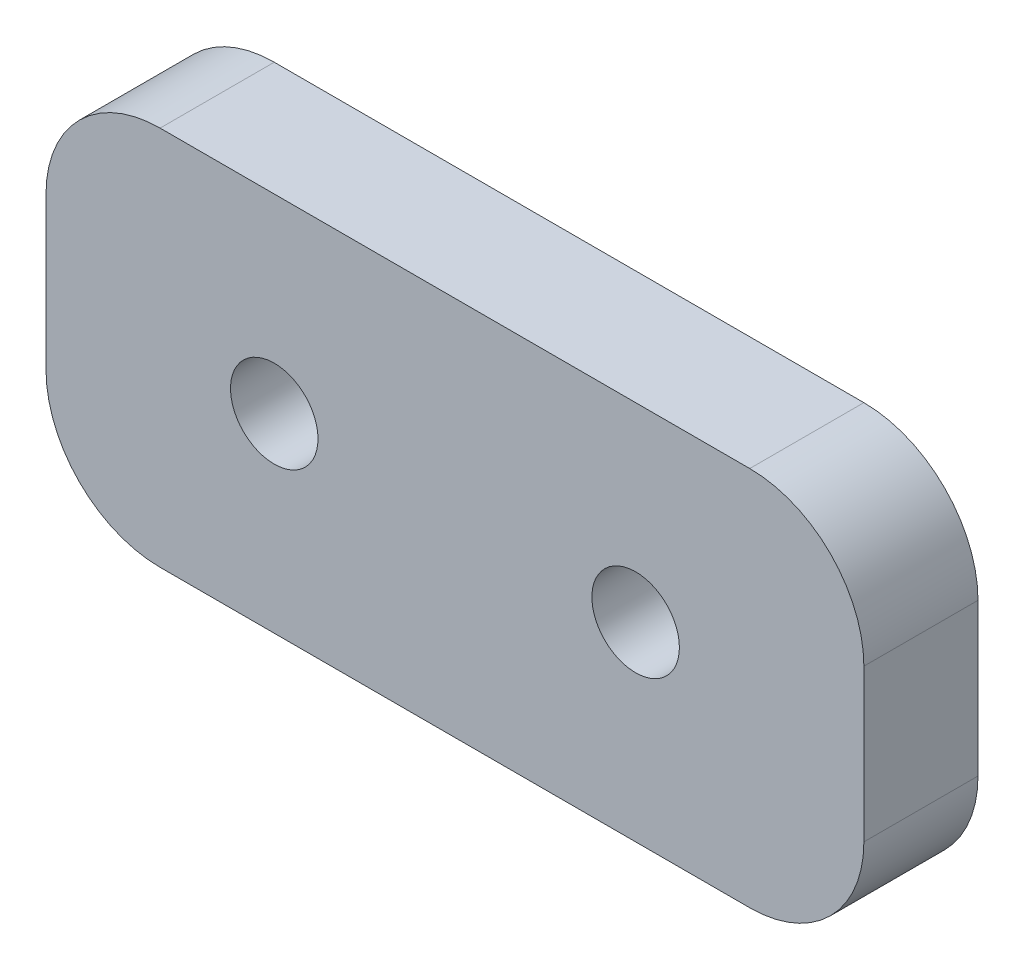
ISO-10303-21;
HEADER;
FILE_DESCRIPTION(('STEP AP214'),'2;1');
FILE_NAME('part.step','',(''),(''),'','','');
FILE_SCHEMA(('AUTOMOTIVE_DESIGN { 1 0 10303 214 1 1 1 1 }'));
ENDSEC;
DATA;
#1=APPLICATION_CONTEXT('core data for automotive mechanical design processes');
#2=APPLICATION_PROTOCOL_DEFINITION('international standard','automotive_design',2000,#1);
#3=PRODUCT_CONTEXT('',#1,'mechanical');
#4=PRODUCT('Part','Part','',(#3));
#5=PRODUCT_RELATED_PRODUCT_CATEGORY('part','',(#4));
#6=PRODUCT_DEFINITION_FORMATION('','',#4);
#7=PRODUCT_DEFINITION_CONTEXT('part definition',#1,'design');
#8=PRODUCT_DEFINITION('design','',#6,#7);
#9=PRODUCT_DEFINITION_SHAPE('','',#8);
#10=(LENGTH_UNIT() NAMED_UNIT(*) SI_UNIT(.MILLI.,.METRE.));
#11=(NAMED_UNIT(*) PLANE_ANGLE_UNIT() SI_UNIT($,.RADIAN.));
#12=(NAMED_UNIT(*) SI_UNIT($,.STERADIAN.) SOLID_ANGLE_UNIT());
#13=UNCERTAINTY_MEASURE_WITH_UNIT(LENGTH_MEASURE(1.E-05),#10,'distance_accuracy_value','');
#14=(GEOMETRIC_REPRESENTATION_CONTEXT(3) GLOBAL_UNCERTAINTY_ASSIGNED_CONTEXT((#13)) GLOBAL_UNIT_ASSIGNED_CONTEXT((#10,
#11,#12)) REPRESENTATION_CONTEXT('',''));
#15=CARTESIAN_POINT('',(0.,0.,0.));
#16=DIRECTION('',(0.,0.,1.));
#17=DIRECTION('',(1.,0.,0.));
#18=AXIS2_PLACEMENT_3D('',#15,#16,#17);
#19=CARTESIAN_POINT('',(0.,0.,3.));
#20=DIRECTION('',(0.,0.,-1.));
#21=DIRECTION('',(-1.,0.,0.));
#22=AXIS2_PLACEMENT_3D('',#19,#20,#21);
#23=PLANE('',#22);
#24=DIRECTION('',(-1.,0.,0.));
#25=VECTOR('',#24,1.);
#26=CARTESIAN_POINT('',(0.,10.,3.));
#27=LINE('',#26,#25);
#28=CARTESIAN_POINT('',(18.5,10.,3.));
#29=VERTEX_POINT('',#28);
#30=CARTESIAN_POINT('',(3.,10.,3.));
#31=VERTEX_POINT('',#30);
#32=EDGE_CURVE('E137',#29,#31,#27,.T.);
#33=ORIENTED_EDGE('',*,*,#32,.T.);
#34=CARTESIAN_POINT('',(3.,7.,3.));
#35=DIRECTION('',(0.,0.,-1.));
#36=DIRECTION('',(-1.,0.,0.));
#37=AXIS2_PLACEMENT_3D('',#34,#35,#36);
#38=CIRCLE('',#37,3.);
#39=CARTESIAN_POINT('',(0.,7.,3.));
#40=VERTEX_POINT('',#39);
#41=EDGE_CURVE('E156',#31,#40,#38,.F.);
#42=ORIENTED_EDGE('',*,*,#41,.T.);
#43=DIRECTION('',(0.,-1.,0.));
#44=VECTOR('',#43,1.);
#45=CARTESIAN_POINT('',(0.,0.,3.));
#46=LINE('',#45,#44);
#47=CARTESIAN_POINT('',(0.,3.,3.));
#48=VERTEX_POINT('',#47);
#49=EDGE_CURVE('E120',#40,#48,#46,.T.);
#50=ORIENTED_EDGE('',*,*,#49,.T.);
#51=CARTESIAN_POINT('',(3.,3.,3.));
#52=DIRECTION('',(0.,0.,-1.));
#53=DIRECTION('',(-1.,0.,0.));
#54=AXIS2_PLACEMENT_3D('',#51,#52,#53);
#55=CIRCLE('',#54,3.);
#56=CARTESIAN_POINT('',(3.,0.,3.));
#57=VERTEX_POINT('',#56);
#58=EDGE_CURVE('E151',#48,#57,#55,.F.);
#59=ORIENTED_EDGE('',*,*,#58,.T.);
#60=DIRECTION('',(1.,0.,0.));
#61=VECTOR('',#60,1.);
#62=CARTESIAN_POINT('',(0.,0.,3.));
#63=LINE('',#62,#61);
#64=CARTESIAN_POINT('',(18.5,0.,3.));
#65=VERTEX_POINT('',#64);
#66=EDGE_CURVE('E167',#57,#65,#63,.T.);
#67=ORIENTED_EDGE('',*,*,#66,.T.);
#68=CARTESIAN_POINT('',(18.5,3.,3.));
#69=DIRECTION('',(0.,0.,-1.));
#70=DIRECTION('',(-1.,0.,0.));
#71=AXIS2_PLACEMENT_3D('',#68,#69,#70);
#72=CIRCLE('',#71,3.);
#73=CARTESIAN_POINT('',(21.5,3.,3.));
#74=VERTEX_POINT('',#73);
#75=EDGE_CURVE('E56',#65,#74,#72,.F.);
#76=ORIENTED_EDGE('',*,*,#75,.T.);
#77=DIRECTION('',(0.,1.,0.));
#78=VECTOR('',#77,1.);
#79=CARTESIAN_POINT('',(21.5,0.,3.));
#80=LINE('',#79,#78);
#81=CARTESIAN_POINT('',(21.5,7.,3.));
#82=VERTEX_POINT('',#81);
#83=EDGE_CURVE('E175',#74,#82,#80,.T.);
#84=ORIENTED_EDGE('',*,*,#83,.T.);
#85=CARTESIAN_POINT('',(18.5,7.,3.));
#86=DIRECTION('',(0.,0.,-1.));
#87=DIRECTION('',(-1.,0.,0.));
#88=AXIS2_PLACEMENT_3D('',#85,#86,#87);
#89=CIRCLE('',#88,3.);
#90=EDGE_CURVE('E154',#82,#29,#89,.F.);
#91=ORIENTED_EDGE('',*,*,#90,.T.);
#92=EDGE_LOOP('',(#33,#42,#50,#59,#67,#76,#84,#91));
#93=FACE_BOUND('',#92,.T.);
#94=CARTESIAN_POINT('',(6.,5.,3.));
#95=DIRECTION('',(0.,0.,1.));
#96=DIRECTION('',(1.,0.,0.));
#97=AXIS2_PLACEMENT_3D('',#94,#95,#96);
#98=CIRCLE('',#97,1.15);
#99=CARTESIAN_POINT('',(7.15,5.,3.));
#100=VERTEX_POINT('',#99);
#101=EDGE_CURVE('E128',#100,#100,#98,.T.);
#102=ORIENTED_EDGE('',*,*,#101,.F.);
#103=EDGE_LOOP('',(#102));
#104=FACE_BOUND('',#103,.T.);
#105=CARTESIAN_POINT('',(15.5,5.,3.));
#106=DIRECTION('',(0.,0.,1.));
#107=DIRECTION('',(1.,0.,0.));
#108=AXIS2_PLACEMENT_3D('',#105,#106,#107);
#109=CIRCLE('',#108,1.15);
#110=CARTESIAN_POINT('',(16.65,5.,3.));
#111=VERTEX_POINT('',#110);
#112=EDGE_CURVE('E182',#111,#111,#109,.T.);
#113=ORIENTED_EDGE('',*,*,#112,.F.);
#114=EDGE_LOOP('',(#113));
#115=FACE_BOUND('',#114,.T.);
#116=ADVANCED_FACE('F34',(#93,#104,#115),#23,.F.);
#117=CARTESIAN_POINT('',(0.,0.,0.));
#118=DIRECTION('',(0.,0.,-1.));
#119=DIRECTION('',(-1.,0.,0.));
#120=AXIS2_PLACEMENT_3D('',#117,#118,#119);
#121=PLANE('',#120);
#122=CARTESIAN_POINT('',(6.,5.,0.));
#123=DIRECTION('',(0.,0.,1.));
#124=DIRECTION('',(1.,0.,0.));
#125=AXIS2_PLACEMENT_3D('',#122,#123,#124);
#126=CIRCLE('',#125,1.15);
#127=CARTESIAN_POINT('',(7.15,5.,0.));
#128=VERTEX_POINT('',#127);
#129=EDGE_CURVE('E134',#128,#128,#126,.T.);
#130=ORIENTED_EDGE('',*,*,#129,.T.);
#131=EDGE_LOOP('',(#130));
#132=FACE_BOUND('',#131,.T.);
#133=DIRECTION('',(0.,-1.,0.));
#134=VECTOR('',#133,1.);
#135=CARTESIAN_POINT('',(0.,0.,0.));
#136=LINE('',#135,#134);
#137=CARTESIAN_POINT('',(0.,7.,0.));
#138=VERTEX_POINT('',#137);
#139=CARTESIAN_POINT('',(0.,3.,0.));
#140=VERTEX_POINT('',#139);
#141=EDGE_CURVE('E117',#138,#140,#136,.T.);
#142=ORIENTED_EDGE('',*,*,#141,.F.);
#143=CARTESIAN_POINT('',(3.,7.,0.));
#144=DIRECTION('',(0.,0.,-1.));
#145=DIRECTION('',(-1.,0.,0.));
#146=AXIS2_PLACEMENT_3D('',#143,#144,#145);
#147=CIRCLE('',#146,3.);
#148=CARTESIAN_POINT('',(3.,10.,0.));
#149=VERTEX_POINT('',#148);
#150=EDGE_CURVE('E100',#138,#149,#147,.T.);
#151=ORIENTED_EDGE('',*,*,#150,.T.);
#152=DIRECTION('',(-1.,0.,0.));
#153=VECTOR('',#152,1.);
#154=CARTESIAN_POINT('',(0.,10.,0.));
#155=LINE('',#154,#153);
#156=CARTESIAN_POINT('',(18.5,10.,0.));
#157=VERTEX_POINT('',#156);
#158=EDGE_CURVE('E141',#157,#149,#155,.T.);
#159=ORIENTED_EDGE('',*,*,#158,.F.);
#160=CARTESIAN_POINT('',(18.5,7.,0.));
#161=DIRECTION('',(0.,0.,-1.));
#162=DIRECTION('',(-1.,0.,0.));
#163=AXIS2_PLACEMENT_3D('',#160,#161,#162);
#164=CIRCLE('',#163,3.);
#165=CARTESIAN_POINT('',(21.5,7.,0.));
#166=VERTEX_POINT('',#165);
#167=EDGE_CURVE('E111',#157,#166,#164,.T.);
#168=ORIENTED_EDGE('',*,*,#167,.T.);
#169=DIRECTION('',(0.,1.,0.));
#170=VECTOR('',#169,1.);
#171=CARTESIAN_POINT('',(21.5,0.,0.));
#172=LINE('',#171,#170);
#173=CARTESIAN_POINT('',(21.5,3.,0.));
#174=VERTEX_POINT('',#173);
#175=EDGE_CURVE('E131',#174,#166,#172,.T.);
#176=ORIENTED_EDGE('',*,*,#175,.F.);
#177=CARTESIAN_POINT('',(18.5,3.,0.));
#178=DIRECTION('',(0.,0.,-1.));
#179=DIRECTION('',(-1.,0.,0.));
#180=AXIS2_PLACEMENT_3D('',#177,#178,#179);
#181=CIRCLE('',#180,3.);
#182=CARTESIAN_POINT('',(18.5,0.,0.));
#183=VERTEX_POINT('',#182);
#184=EDGE_CURVE('E145',#174,#183,#181,.T.);
#185=ORIENTED_EDGE('',*,*,#184,.T.);
#186=DIRECTION('',(1.,0.,0.));
#187=VECTOR('',#186,1.);
#188=CARTESIAN_POINT('',(0.,0.,0.));
#189=LINE('',#188,#187);
#190=CARTESIAN_POINT('',(3.,0.,0.));
#191=VERTEX_POINT('',#190);
#192=EDGE_CURVE('E127',#191,#183,#189,.T.);
#193=ORIENTED_EDGE('',*,*,#192,.F.);
#194=CARTESIAN_POINT('',(3.,3.,0.));
#195=DIRECTION('',(0.,0.,-1.));
#196=DIRECTION('',(-1.,0.,0.));
#197=AXIS2_PLACEMENT_3D('',#194,#195,#196);
#198=CIRCLE('',#197,3.);
#199=EDGE_CURVE('E121',#191,#140,#198,.T.);
#200=ORIENTED_EDGE('',*,*,#199,.T.);
#201=EDGE_LOOP('',(#142,#151,#159,#168,#176,#185,#193,#200));
#202=FACE_BOUND('',#201,.T.);
#203=CARTESIAN_POINT('',(15.5,5.,0.));
#204=DIRECTION('',(0.,0.,1.));
#205=DIRECTION('',(1.,0.,0.));
#206=AXIS2_PLACEMENT_3D('',#203,#204,#205);
#207=CIRCLE('',#206,1.15);
#208=CARTESIAN_POINT('',(16.65,5.,0.));
#209=VERTEX_POINT('',#208);
#210=EDGE_CURVE('E184',#209,#209,#207,.T.);
#211=ORIENTED_EDGE('',*,*,#210,.T.);
#212=EDGE_LOOP('',(#211));
#213=FACE_BOUND('',#212,.T.);
#214=ADVANCED_FACE('F124',(#132,#202,#213),#121,.T.);
#215=CARTESIAN_POINT('',(0.,0.,3.));
#216=DIRECTION('',(1.,0.,0.));
#217=DIRECTION('',(0.,0.,-1.));
#218=AXIS2_PLACEMENT_3D('',#215,#216,#217);
#219=PLANE('',#218);
#220=ORIENTED_EDGE('',*,*,#49,.F.);
#221=DIRECTION('',(0.,0.,-1.));
#222=VECTOR('',#221,1.);
#223=CARTESIAN_POINT('',(0.,7.,3.));
#224=LINE('',#223,#222);
#225=EDGE_CURVE('E104',#40,#138,#224,.T.);
#226=ORIENTED_EDGE('',*,*,#225,.T.);
#227=ORIENTED_EDGE('',*,*,#141,.T.);
#228=DIRECTION('',(0.,0.,-1.));
#229=VECTOR('',#228,1.);
#230=CARTESIAN_POINT('',(0.,3.,3.));
#231=LINE('',#230,#229);
#232=EDGE_CURVE('E122',#140,#48,#231,.F.);
#233=ORIENTED_EDGE('',*,*,#232,.T.);
#234=EDGE_LOOP('',(#220,#226,#227,#233));
#235=FACE_BOUND('',#234,.T.);
#236=ADVANCED_FACE('F116',(#235),#219,.F.);
#237=CARTESIAN_POINT('',(0.,0.,3.));
#238=DIRECTION('',(0.,1.,0.));
#239=DIRECTION('',(0.,0.,1.));
#240=AXIS2_PLACEMENT_3D('',#237,#238,#239);
#241=PLANE('',#240);
#242=ORIENTED_EDGE('',*,*,#192,.T.);
#243=DIRECTION('',(0.,0.,-1.));
#244=VECTOR('',#243,1.);
#245=CARTESIAN_POINT('',(18.5,0.,3.));
#246=LINE('',#245,#244);
#247=EDGE_CURVE('E11',#183,#65,#246,.F.);
#248=ORIENTED_EDGE('',*,*,#247,.T.);
#249=ORIENTED_EDGE('',*,*,#66,.F.);
#250=DIRECTION('',(0.,0.,-1.));
#251=VECTOR('',#250,1.);
#252=CARTESIAN_POINT('',(3.,0.,3.));
#253=LINE('',#252,#251);
#254=EDGE_CURVE('E42',#57,#191,#253,.T.);
#255=ORIENTED_EDGE('',*,*,#254,.T.);
#256=EDGE_LOOP('',(#242,#248,#249,#255));
#257=FACE_BOUND('',#256,.T.);
#258=ADVANCED_FACE('F165',(#257),#241,.F.);
#259=CARTESIAN_POINT('',(21.5,0.,3.));
#260=DIRECTION('',(-1.,0.,0.));
#261=DIRECTION('',(0.,0.,1.));
#262=AXIS2_PLACEMENT_3D('',#259,#260,#261);
#263=PLANE('',#262);
#264=ORIENTED_EDGE('',*,*,#175,.T.);
#265=DIRECTION('',(0.,0.,-1.));
#266=VECTOR('',#265,1.);
#267=CARTESIAN_POINT('',(21.5,7.,3.));
#268=LINE('',#267,#266);
#269=EDGE_CURVE('E49',#166,#82,#268,.F.);
#270=ORIENTED_EDGE('',*,*,#269,.T.);
#271=ORIENTED_EDGE('',*,*,#83,.F.);
#272=DIRECTION('',(0.,0.,-1.));
#273=VECTOR('',#272,1.);
#274=CARTESIAN_POINT('',(21.5,3.,3.));
#275=LINE('',#274,#273);
#276=EDGE_CURVE('E158',#74,#174,#275,.T.);
#277=ORIENTED_EDGE('',*,*,#276,.T.);
#278=EDGE_LOOP('',(#264,#270,#271,#277));
#279=FACE_BOUND('',#278,.T.);
#280=ADVANCED_FACE('F174',(#279),#263,.F.);
#281=CARTESIAN_POINT('',(0.,10.,3.));
#282=DIRECTION('',(0.,-1.,0.));
#283=DIRECTION('',(0.,0.,-1.));
#284=AXIS2_PLACEMENT_3D('',#281,#282,#283);
#285=PLANE('',#284);
#286=ORIENTED_EDGE('',*,*,#158,.T.);
#287=DIRECTION('',(0.,0.,-1.));
#288=VECTOR('',#287,1.);
#289=CARTESIAN_POINT('',(3.,10.,3.));
#290=LINE('',#289,#288);
#291=EDGE_CURVE('E105',#149,#31,#290,.F.);
#292=ORIENTED_EDGE('',*,*,#291,.T.);
#293=ORIENTED_EDGE('',*,*,#32,.F.);
#294=DIRECTION('',(0.,0.,-1.));
#295=VECTOR('',#294,1.);
#296=CARTESIAN_POINT('',(18.5,10.,3.));
#297=LINE('',#296,#295);
#298=EDGE_CURVE('E110',#29,#157,#297,.T.);
#299=ORIENTED_EDGE('',*,*,#298,.T.);
#300=EDGE_LOOP('',(#286,#292,#293,#299));
#301=FACE_BOUND('',#300,.T.);
#302=ADVANCED_FACE('F205',(#301),#285,.F.);
#303=CARTESIAN_POINT('',(6.,5.,3.));
#304=DIRECTION('',(0.,0.,-1.));
#305=DIRECTION('',(-1.,0.,0.));
#306=AXIS2_PLACEMENT_3D('',#303,#304,#305);
#307=CYLINDRICAL_SURFACE('',#306,1.15);
#308=ORIENTED_EDGE('',*,*,#101,.T.);
#309=EDGE_LOOP('',(#308));
#310=FACE_BOUND('',#309,.T.);
#311=ORIENTED_EDGE('',*,*,#129,.F.);
#312=EDGE_LOOP('',(#311));
#313=FACE_BOUND('',#312,.T.);
#314=ADVANCED_FACE('F202',(#310,#313),#307,.F.);
#315=CARTESIAN_POINT('',(15.5,5.,3.));
#316=DIRECTION('',(0.,0.,-1.));
#317=DIRECTION('',(-1.,0.,0.));
#318=AXIS2_PLACEMENT_3D('',#315,#316,#317);
#319=CYLINDRICAL_SURFACE('',#318,1.15);
#320=ORIENTED_EDGE('',*,*,#112,.T.);
#321=EDGE_LOOP('',(#320));
#322=FACE_BOUND('',#321,.T.);
#323=ORIENTED_EDGE('',*,*,#210,.F.);
#324=EDGE_LOOP('',(#323));
#325=FACE_BOUND('',#324,.T.);
#326=ADVANCED_FACE('F190',(#322,#325),#319,.F.);
#327=CARTESIAN_POINT('',(3.,7.,3.));
#328=DIRECTION('',(0.,0.,-1.));
#329=DIRECTION('',(-1.,0.,0.));
#330=AXIS2_PLACEMENT_3D('',#327,#328,#329);
#331=CYLINDRICAL_SURFACE('',#330,3.);
#332=ORIENTED_EDGE('',*,*,#41,.F.);
#333=ORIENTED_EDGE('',*,*,#291,.F.);
#334=ORIENTED_EDGE('',*,*,#150,.F.);
#335=ORIENTED_EDGE('',*,*,#225,.F.);
#336=EDGE_LOOP('',(#332,#333,#334,#335));
#337=FACE_BOUND('',#336,.T.);
#338=ADVANCED_FACE('F103',(#337),#331,.T.);
#339=CARTESIAN_POINT('',(18.5,7.,3.));
#340=DIRECTION('',(0.,0.,-1.));
#341=DIRECTION('',(-1.,0.,0.));
#342=AXIS2_PLACEMENT_3D('',#339,#340,#341);
#343=CYLINDRICAL_SURFACE('',#342,3.);
#344=ORIENTED_EDGE('',*,*,#90,.F.);
#345=ORIENTED_EDGE('',*,*,#269,.F.);
#346=ORIENTED_EDGE('',*,*,#167,.F.);
#347=ORIENTED_EDGE('',*,*,#298,.F.);
#348=EDGE_LOOP('',(#344,#345,#346,#347));
#349=FACE_BOUND('',#348,.T.);
#350=ADVANCED_FACE('F217',(#349),#343,.T.);
#351=CARTESIAN_POINT('',(18.5,3.,3.));
#352=DIRECTION('',(0.,0.,-1.));
#353=DIRECTION('',(-1.,0.,0.));
#354=AXIS2_PLACEMENT_3D('',#351,#352,#353);
#355=CYLINDRICAL_SURFACE('',#354,3.);
#356=ORIENTED_EDGE('',*,*,#75,.F.);
#357=ORIENTED_EDGE('',*,*,#247,.F.);
#358=ORIENTED_EDGE('',*,*,#184,.F.);
#359=ORIENTED_EDGE('',*,*,#276,.F.);
#360=EDGE_LOOP('',(#356,#357,#358,#359));
#361=FACE_BOUND('',#360,.T.);
#362=ADVANCED_FACE('F173',(#361),#355,.T.);
#363=CARTESIAN_POINT('',(3.,3.,3.));
#364=DIRECTION('',(0.,0.,-1.));
#365=DIRECTION('',(-1.,0.,0.));
#366=AXIS2_PLACEMENT_3D('',#363,#364,#365);
#367=CYLINDRICAL_SURFACE('',#366,3.);
#368=ORIENTED_EDGE('',*,*,#58,.F.);
#369=ORIENTED_EDGE('',*,*,#232,.F.);
#370=ORIENTED_EDGE('',*,*,#199,.F.);
#371=ORIENTED_EDGE('',*,*,#254,.F.);
#372=EDGE_LOOP('',(#368,#369,#370,#371));
#373=FACE_BOUND('',#372,.T.);
#374=ADVANCED_FACE('F36',(#373),#367,.T.);
#375=CLOSED_SHELL('',(#116,#214,#236,#258,#280,#302,#314,#326,#338,#350,#362,#374));
#376=MANIFOLD_SOLID_BREP('B2',#375);
#377=ADVANCED_BREP_SHAPE_REPRESENTATION('',(#18,#376),#14);
#378=SHAPE_DEFINITION_REPRESENTATION(#9,#377);
ENDSEC;
END-ISO-10303-21;
